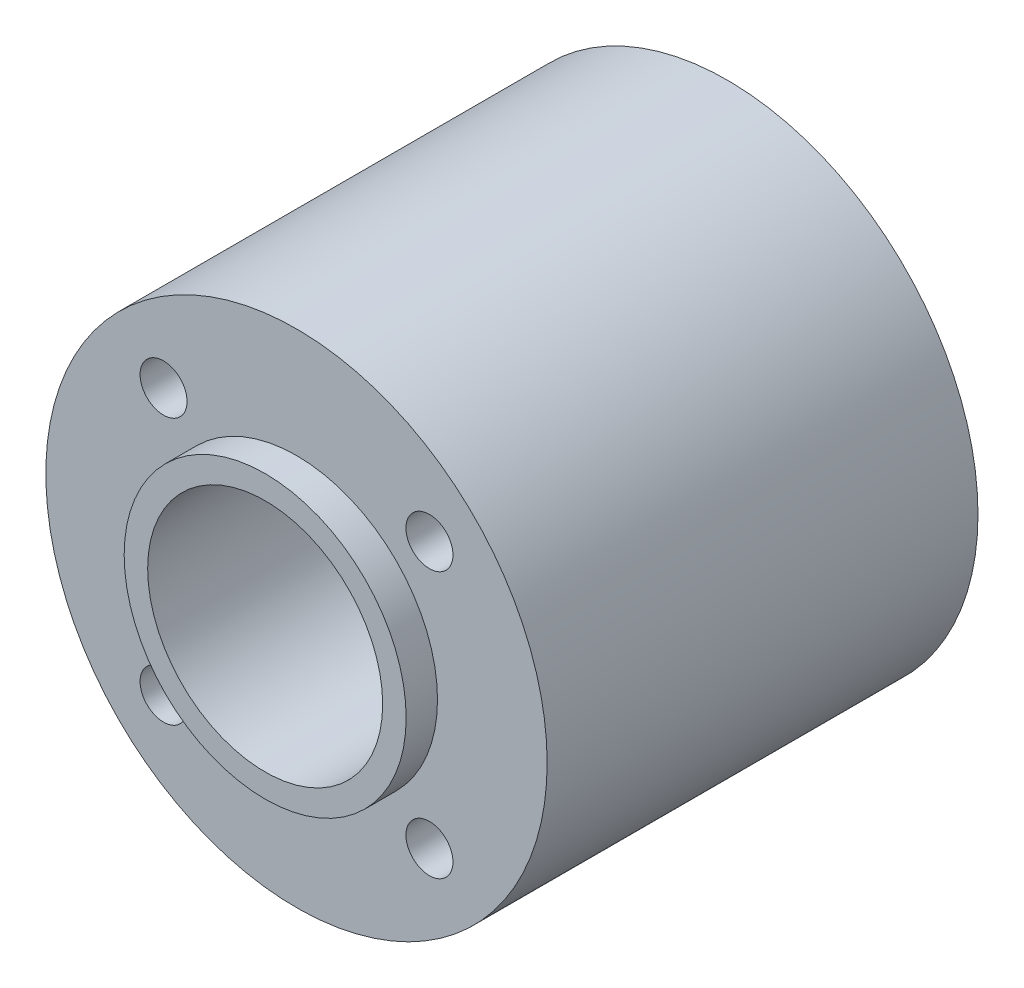
ISO-10303-21;
HEADER;
FILE_DESCRIPTION(('STEP AP214'),'2;1');
FILE_NAME('part.step','',(''),(''),'','','');
FILE_SCHEMA(('AUTOMOTIVE_DESIGN { 1 0 10303 214 1 1 1 1 }'));
ENDSEC;
DATA;
#1=APPLICATION_CONTEXT('core data for automotive mechanical design processes');
#2=APPLICATION_PROTOCOL_DEFINITION('international standard','automotive_design',2000,#1);
#3=PRODUCT_CONTEXT('',#1,'mechanical');
#4=PRODUCT('Part','Part','',(#3));
#5=PRODUCT_RELATED_PRODUCT_CATEGORY('part','',(#4));
#6=PRODUCT_DEFINITION_FORMATION('','',#4);
#7=PRODUCT_DEFINITION_CONTEXT('part definition',#1,'design');
#8=PRODUCT_DEFINITION('design','',#6,#7);
#9=PRODUCT_DEFINITION_SHAPE('','',#8);
#10=(LENGTH_UNIT() NAMED_UNIT(*) SI_UNIT(.MILLI.,.METRE.));
#11=(NAMED_UNIT(*) PLANE_ANGLE_UNIT() SI_UNIT($,.RADIAN.));
#12=(NAMED_UNIT(*) SI_UNIT($,.STERADIAN.) SOLID_ANGLE_UNIT());
#13=UNCERTAINTY_MEASURE_WITH_UNIT(LENGTH_MEASURE(1.E-05),#10,'distance_accuracy_value','');
#14=(GEOMETRIC_REPRESENTATION_CONTEXT(3) GLOBAL_UNCERTAINTY_ASSIGNED_CONTEXT((#13)) GLOBAL_UNIT_ASSIGNED_CONTEXT((#10,
#11,#12)) REPRESENTATION_CONTEXT('',''));
#15=CARTESIAN_POINT('',(0.,0.,0.));
#16=DIRECTION('',(0.,0.,1.));
#17=DIRECTION('',(1.,0.,0.));
#18=AXIS2_PLACEMENT_3D('',#15,#16,#17);
#19=CARTESIAN_POINT('',(0.,0.,-55.));
#20=DIRECTION('',(0.,0.,1.));
#21=DIRECTION('',(1.,0.,0.));
#22=AXIS2_PLACEMENT_3D('',#19,#20,#21);
#23=CYLINDRICAL_SURFACE('',#22,32.);
#24=CARTESIAN_POINT('',(0.,0.,-55.));
#25=DIRECTION('',(0.,0.,1.));
#26=DIRECTION('',(1.,0.,0.));
#27=AXIS2_PLACEMENT_3D('',#24,#25,#26);
#28=CIRCLE('',#27,32.);
#29=CARTESIAN_POINT('',(32.,0.,-55.));
#30=VERTEX_POINT('',#29);
#31=EDGE_CURVE('E11',#30,#30,#28,.T.);
#32=ORIENTED_EDGE('',*,*,#31,.T.);
#33=EDGE_LOOP('',(#32));
#34=FACE_BOUND('',#33,.T.);
#35=CARTESIAN_POINT('',(0.,0.,0.));
#36=DIRECTION('',(0.,0.,1.));
#37=DIRECTION('',(1.,0.,0.));
#38=AXIS2_PLACEMENT_3D('',#35,#36,#37);
#39=CIRCLE('',#38,32.);
#40=CARTESIAN_POINT('',(32.,0.,0.));
#41=VERTEX_POINT('',#40);
#42=EDGE_CURVE('E46',#41,#41,#39,.T.);
#43=ORIENTED_EDGE('',*,*,#42,.F.);
#44=EDGE_LOOP('',(#43));
#45=FACE_BOUND('',#44,.T.);
#46=ADVANCED_FACE('F43',(#34,#45),#23,.T.);
#47=CARTESIAN_POINT('',(0.,0.,-55.));
#48=DIRECTION('',(0.,0.,1.));
#49=DIRECTION('',(1.,0.,0.));
#50=AXIS2_PLACEMENT_3D('',#47,#48,#49);
#51=CYLINDRICAL_SURFACE('',#50,15.);
#52=CARTESIAN_POINT('',(0.,0.,4.));
#53=DIRECTION('',(0.,0.,1.));
#54=DIRECTION('',(1.,0.,0.));
#55=AXIS2_PLACEMENT_3D('',#52,#53,#54);
#56=CIRCLE('',#55,15.);
#57=CARTESIAN_POINT('',(15.,0.,4.));
#58=VERTEX_POINT('',#57);
#59=EDGE_CURVE('E58',#58,#58,#56,.T.);
#60=ORIENTED_EDGE('',*,*,#59,.T.);
#61=EDGE_LOOP('',(#60));
#62=FACE_BOUND('',#61,.T.);
#63=CARTESIAN_POINT('',(0.,0.,-59.));
#64=DIRECTION('',(0.,0.,1.));
#65=DIRECTION('',(1.,0.,0.));
#66=AXIS2_PLACEMENT_3D('',#63,#64,#65);
#67=CIRCLE('',#66,15.);
#68=CARTESIAN_POINT('',(15.,0.,-59.));
#69=VERTEX_POINT('',#68);
#70=EDGE_CURVE('E67',#69,#69,#67,.T.);
#71=ORIENTED_EDGE('',*,*,#70,.F.);
#72=EDGE_LOOP('',(#71));
#73=FACE_BOUND('',#72,.T.);
#74=ADVANCED_FACE('F114',(#62,#73),#51,.F.);
#75=CARTESIAN_POINT('',(0.,0.,-55.));
#76=DIRECTION('',(0.,0.,1.));
#77=DIRECTION('',(1.,0.,0.));
#78=AXIS2_PLACEMENT_3D('',#75,#76,#77);
#79=PLANE('',#78);
#80=CARTESIAN_POINT('',(-16.9705627484771,-16.9705627484772,-55.));
#81=DIRECTION('',(0.,0.,1.));
#82=DIRECTION('',(1.,0.,0.));
#83=AXIS2_PLACEMENT_3D('',#80,#81,#82);
#84=CIRCLE('',#83,3.00000000000022);
#85=CARTESIAN_POINT('',(-13.9705627484768,-16.9705627484772,-55.));
#86=VERTEX_POINT('',#85);
#87=EDGE_CURVE('E72',#86,#86,#84,.T.);
#88=ORIENTED_EDGE('',*,*,#87,.T.);
#89=EDGE_LOOP('',(#88));
#90=FACE_BOUND('',#89,.T.);
#91=CARTESIAN_POINT('',(16.9705627484772,-16.9705627484771,-55.));
#92=DIRECTION('',(0.,0.,1.));
#93=DIRECTION('',(1.,0.,0.));
#94=AXIS2_PLACEMENT_3D('',#91,#92,#93);
#95=CIRCLE('',#94,3.00000000000015);
#96=CARTESIAN_POINT('',(19.9705627484774,-16.9705627484771,-55.));
#97=VERTEX_POINT('',#96);
#98=EDGE_CURVE('E75',#97,#97,#95,.T.);
#99=ORIENTED_EDGE('',*,*,#98,.T.);
#100=EDGE_LOOP('',(#99));
#101=FACE_BOUND('',#100,.T.);
#102=CARTESIAN_POINT('',(16.9705627484771,16.9705627484772,-55.));
#103=DIRECTION('',(0.,0.,1.));
#104=DIRECTION('',(1.,0.,0.));
#105=AXIS2_PLACEMENT_3D('',#102,#103,#104);
#106=CIRCLE('',#105,3.00000000000007);
#107=CARTESIAN_POINT('',(19.9705627484771,16.9705627484772,-55.));
#108=VERTEX_POINT('',#107);
#109=EDGE_CURVE('E78',#108,#108,#106,.T.);
#110=ORIENTED_EDGE('',*,*,#109,.T.);
#111=EDGE_LOOP('',(#110));
#112=FACE_BOUND('',#111,.T.);
#113=CARTESIAN_POINT('',(-16.9705627484772,16.9705627484771,-55.));
#114=DIRECTION('',(0.,0.,1.));
#115=DIRECTION('',(1.,0.,0.));
#116=AXIS2_PLACEMENT_3D('',#113,#114,#115);
#117=CIRCLE('',#116,3.);
#118=CARTESIAN_POINT('',(-13.9705627484772,16.9705627484771,-55.));
#119=VERTEX_POINT('',#118);
#120=EDGE_CURVE('E81',#119,#119,#117,.T.);
#121=ORIENTED_EDGE('',*,*,#120,.T.);
#122=EDGE_LOOP('',(#121));
#123=FACE_BOUND('',#122,.T.);
#124=CARTESIAN_POINT('',(0.,0.,-55.));
#125=DIRECTION('',(0.,0.,1.));
#126=DIRECTION('',(1.,0.,0.));
#127=AXIS2_PLACEMENT_3D('',#124,#125,#126);
#128=CIRCLE('',#127,18.);
#129=CARTESIAN_POINT('',(18.,0.,-55.));
#130=VERTEX_POINT('',#129);
#131=EDGE_CURVE('E64',#130,#130,#128,.T.);
#132=ORIENTED_EDGE('',*,*,#131,.T.);
#133=EDGE_LOOP('',(#132));
#134=FACE_BOUND('',#133,.T.);
#135=ORIENTED_EDGE('',*,*,#31,.F.);
#136=EDGE_LOOP('',(#135));
#137=FACE_BOUND('',#136,.T.);
#138=ADVANCED_FACE('F104',(#90,#101,#112,#123,#134,#137),#79,.F.);
#139=CARTESIAN_POINT('',(0.,0.,0.));
#140=DIRECTION('',(0.,0.,1.));
#141=DIRECTION('',(1.,0.,0.));
#142=AXIS2_PLACEMENT_3D('',#139,#140,#141);
#143=PLANE('',#142);
#144=CARTESIAN_POINT('',(-16.9705627484771,-16.9705627484772,0.));
#145=DIRECTION('',(0.,0.,1.));
#146=DIRECTION('',(1.,0.,0.));
#147=AXIS2_PLACEMENT_3D('',#144,#145,#146);
#148=CIRCLE('',#147,3.00000000000022);
#149=CARTESIAN_POINT('',(-13.9705627484768,-16.9705627484772,0.));
#150=VERTEX_POINT('',#149);
#151=EDGE_CURVE('E88',#150,#150,#148,.T.);
#152=ORIENTED_EDGE('',*,*,#151,.F.);
#153=EDGE_LOOP('',(#152));
#154=FACE_BOUND('',#153,.T.);
#155=CARTESIAN_POINT('',(16.9705627484772,-16.9705627484771,0.));
#156=DIRECTION('',(0.,0.,1.));
#157=DIRECTION('',(1.,0.,0.));
#158=AXIS2_PLACEMENT_3D('',#155,#156,#157);
#159=CIRCLE('',#158,3.00000000000015);
#160=CARTESIAN_POINT('',(19.9705627484774,-16.9705627484771,0.));
#161=VERTEX_POINT('',#160);
#162=EDGE_CURVE('E91',#161,#161,#159,.T.);
#163=ORIENTED_EDGE('',*,*,#162,.F.);
#164=EDGE_LOOP('',(#163));
#165=FACE_BOUND('',#164,.T.);
#166=CARTESIAN_POINT('',(16.9705627484771,16.9705627484772,0.));
#167=DIRECTION('',(0.,0.,1.));
#168=DIRECTION('',(1.,0.,0.));
#169=AXIS2_PLACEMENT_3D('',#166,#167,#168);
#170=CIRCLE('',#169,3.00000000000007);
#171=CARTESIAN_POINT('',(19.9705627484771,16.9705627484772,0.));
#172=VERTEX_POINT('',#171);
#173=EDGE_CURVE('E87',#172,#172,#170,.T.);
#174=ORIENTED_EDGE('',*,*,#173,.F.);
#175=EDGE_LOOP('',(#174));
#176=FACE_BOUND('',#175,.T.);
#177=CARTESIAN_POINT('',(-16.9705627484772,16.9705627484771,0.));
#178=DIRECTION('',(0.,0.,1.));
#179=DIRECTION('',(1.,0.,0.));
#180=AXIS2_PLACEMENT_3D('',#177,#178,#179);
#181=CIRCLE('',#180,3.);
#182=CARTESIAN_POINT('',(-13.9705627484772,16.9705627484771,0.));
#183=VERTEX_POINT('',#182);
#184=EDGE_CURVE('E84',#183,#183,#181,.T.);
#185=ORIENTED_EDGE('',*,*,#184,.F.);
#186=EDGE_LOOP('',(#185));
#187=FACE_BOUND('',#186,.T.);
#188=CARTESIAN_POINT('',(0.,0.,0.));
#189=DIRECTION('',(0.,0.,1.));
#190=DIRECTION('',(1.,0.,0.));
#191=AXIS2_PLACEMENT_3D('',#188,#189,#190);
#192=CIRCLE('',#191,18.);
#193=CARTESIAN_POINT('',(18.,0.,0.));
#194=VERTEX_POINT('',#193);
#195=EDGE_CURVE('E55',#194,#194,#192,.T.);
#196=ORIENTED_EDGE('',*,*,#195,.F.);
#197=EDGE_LOOP('',(#196));
#198=FACE_BOUND('',#197,.T.);
#199=ORIENTED_EDGE('',*,*,#42,.T.);
#200=EDGE_LOOP('',(#199));
#201=FACE_BOUND('',#200,.T.);
#202=ADVANCED_FACE('F100',(#154,#165,#176,#187,#198,#201),#143,.T.);
#203=CARTESIAN_POINT('',(0.,0.,4.));
#204=DIRECTION('',(0.,0.,-1.));
#205=DIRECTION('',(-1.,0.,0.));
#206=AXIS2_PLACEMENT_3D('',#203,#204,#205);
#207=CYLINDRICAL_SURFACE('',#206,18.);
#208=CARTESIAN_POINT('',(0.,0.,4.));
#209=DIRECTION('',(0.,0.,1.));
#210=DIRECTION('',(1.,0.,0.));
#211=AXIS2_PLACEMENT_3D('',#208,#209,#210);
#212=CIRCLE('',#211,18.);
#213=CARTESIAN_POINT('',(18.,0.,4.));
#214=VERTEX_POINT('',#213);
#215=EDGE_CURVE('E53',#214,#214,#212,.T.);
#216=ORIENTED_EDGE('',*,*,#215,.F.);
#217=EDGE_LOOP('',(#216));
#218=FACE_BOUND('',#217,.T.);
#219=ORIENTED_EDGE('',*,*,#195,.T.);
#220=EDGE_LOOP('',(#219));
#221=FACE_BOUND('',#220,.T.);
#222=ADVANCED_FACE('F103',(#218,#221),#207,.T.);
#223=CARTESIAN_POINT('',(0.,0.,4.));
#224=DIRECTION('',(0.,0.,1.));
#225=DIRECTION('',(1.,0.,0.));
#226=AXIS2_PLACEMENT_3D('',#223,#224,#225);
#227=PLANE('',#226);
#228=ORIENTED_EDGE('',*,*,#59,.F.);
#229=EDGE_LOOP('',(#228));
#230=FACE_BOUND('',#229,.T.);
#231=ORIENTED_EDGE('',*,*,#215,.T.);
#232=EDGE_LOOP('',(#231));
#233=FACE_BOUND('',#232,.T.);
#234=ADVANCED_FACE('F128',(#230,#233),#227,.T.);
#235=CARTESIAN_POINT('',(0.,0.,-59.));
#236=DIRECTION('',(0.,0.,1.));
#237=DIRECTION('',(1.,0.,0.));
#238=AXIS2_PLACEMENT_3D('',#235,#236,#237);
#239=CYLINDRICAL_SURFACE('',#238,18.);
#240=CARTESIAN_POINT('',(0.,0.,-59.));
#241=DIRECTION('',(0.,0.,1.));
#242=DIRECTION('',(1.,0.,0.));
#243=AXIS2_PLACEMENT_3D('',#240,#241,#242);
#244=CIRCLE('',#243,18.);
#245=CARTESIAN_POINT('',(18.,0.,-59.));
#246=VERTEX_POINT('',#245);
#247=EDGE_CURVE('E59',#246,#246,#244,.T.);
#248=ORIENTED_EDGE('',*,*,#247,.T.);
#249=EDGE_LOOP('',(#248));
#250=FACE_BOUND('',#249,.T.);
#251=ORIENTED_EDGE('',*,*,#131,.F.);
#252=EDGE_LOOP('',(#251));
#253=FACE_BOUND('',#252,.T.);
#254=ADVANCED_FACE('F132',(#250,#253),#239,.T.);
#255=CARTESIAN_POINT('',(0.,0.,-59.));
#256=DIRECTION('',(0.,0.,1.));
#257=DIRECTION('',(1.,0.,0.));
#258=AXIS2_PLACEMENT_3D('',#255,#256,#257);
#259=PLANE('',#258);
#260=ORIENTED_EDGE('',*,*,#70,.T.);
#261=EDGE_LOOP('',(#260));
#262=FACE_BOUND('',#261,.T.);
#263=ORIENTED_EDGE('',*,*,#247,.F.);
#264=EDGE_LOOP('',(#263));
#265=FACE_BOUND('',#264,.T.);
#266=ADVANCED_FACE('F136',(#262,#265),#259,.F.);
#267=CARTESIAN_POINT('',(-16.9705627484772,16.9705627484771,-191.));
#268=DIRECTION('',(0.,0.,1.));
#269=DIRECTION('',(1.,0.,0.));
#270=AXIS2_PLACEMENT_3D('',#267,#268,#269);
#271=CYLINDRICAL_SURFACE('',#270,3.);
#272=ORIENTED_EDGE('',*,*,#184,.T.);
#273=EDGE_LOOP('',(#272));
#274=FACE_BOUND('',#273,.T.);
#275=ORIENTED_EDGE('',*,*,#120,.F.);
#276=EDGE_LOOP('',(#275));
#277=FACE_BOUND('',#276,.T.);
#278=ADVANCED_FACE('F140',(#274,#277),#271,.F.);
#279=CARTESIAN_POINT('',(16.9705627484771,16.9705627484772,-191.));
#280=DIRECTION('',(0.,0.,1.));
#281=DIRECTION('',(1.,0.,0.));
#282=AXIS2_PLACEMENT_3D('',#279,#280,#281);
#283=CYLINDRICAL_SURFACE('',#282,3.00000000000007);
#284=ORIENTED_EDGE('',*,*,#173,.T.);
#285=EDGE_LOOP('',(#284));
#286=FACE_BOUND('',#285,.T.);
#287=ORIENTED_EDGE('',*,*,#109,.F.);
#288=EDGE_LOOP('',(#287));
#289=FACE_BOUND('',#288,.T.);
#290=ADVANCED_FACE('F97',(#286,#289),#283,.F.);
#291=CARTESIAN_POINT('',(16.9705627484772,-16.9705627484771,-191.));
#292=DIRECTION('',(0.,0.,1.));
#293=DIRECTION('',(1.,0.,0.));
#294=AXIS2_PLACEMENT_3D('',#291,#292,#293);
#295=CYLINDRICAL_SURFACE('',#294,3.00000000000015);
#296=ORIENTED_EDGE('',*,*,#162,.T.);
#297=EDGE_LOOP('',(#296));
#298=FACE_BOUND('',#297,.T.);
#299=ORIENTED_EDGE('',*,*,#98,.F.);
#300=EDGE_LOOP('',(#299));
#301=FACE_BOUND('',#300,.T.);
#302=ADVANCED_FACE('F148',(#298,#301),#295,.F.);
#303=CARTESIAN_POINT('',(-16.9705627484771,-16.9705627484772,-191.));
#304=DIRECTION('',(0.,0.,1.));
#305=DIRECTION('',(1.,0.,0.));
#306=AXIS2_PLACEMENT_3D('',#303,#304,#305);
#307=CYLINDRICAL_SURFACE('',#306,3.00000000000022);
#308=ORIENTED_EDGE('',*,*,#151,.T.);
#309=EDGE_LOOP('',(#308));
#310=FACE_BOUND('',#309,.T.);
#311=ORIENTED_EDGE('',*,*,#87,.F.);
#312=EDGE_LOOP('',(#311));
#313=FACE_BOUND('',#312,.T.);
#314=ADVANCED_FACE('F145',(#310,#313),#307,.F.);
#315=CLOSED_SHELL('',(#46,#74,#138,#202,#222,#234,#254,#266,#278,#290,#302,#314));
#316=MANIFOLD_SOLID_BREP('B2',#315);
#317=ADVANCED_BREP_SHAPE_REPRESENTATION('',(#18,#316),#14);
#318=SHAPE_DEFINITION_REPRESENTATION(#9,#317);
ENDSEC;
END-ISO-10303-21;
